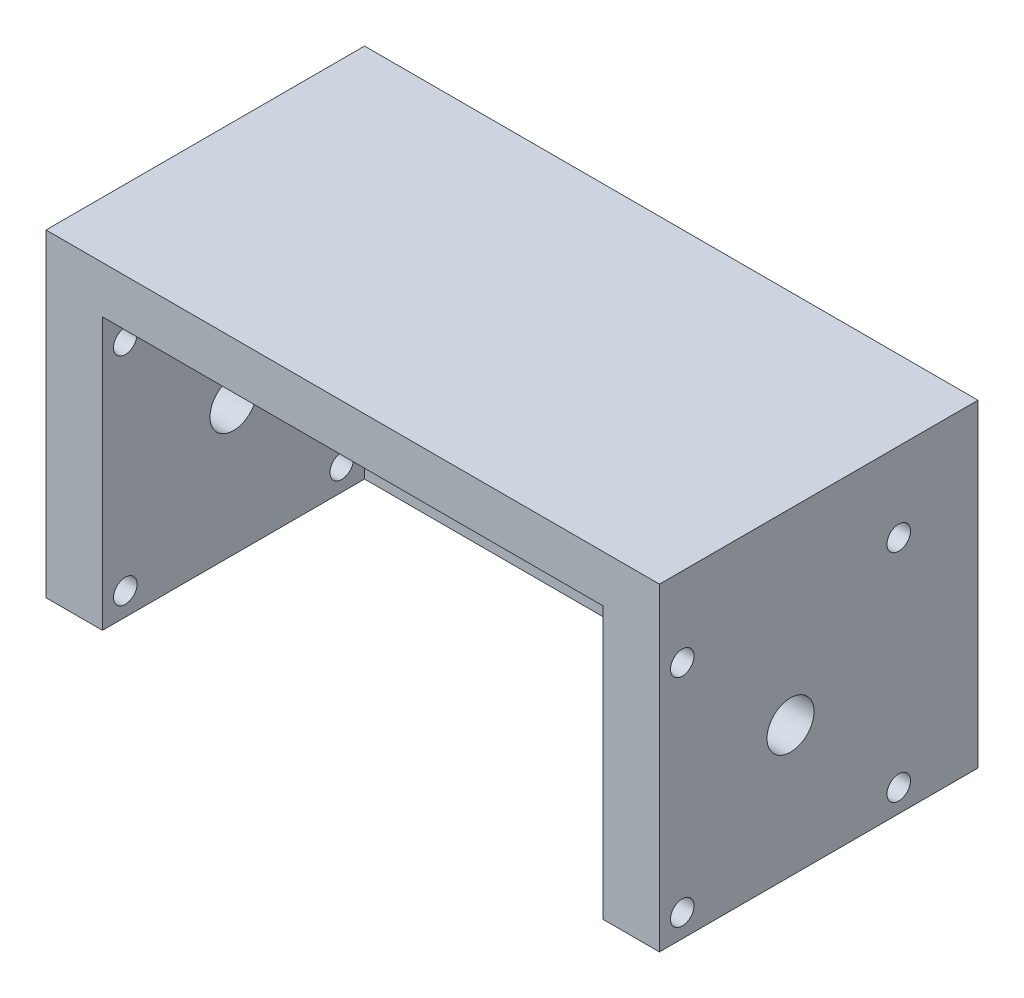
ISO-10303-21;
HEADER;
FILE_DESCRIPTION(('STEP AP214'),'2;1');
FILE_NAME('part.step','',(''),(''),'','','');
FILE_SCHEMA(('AUTOMOTIVE_DESIGN { 1 0 10303 214 1 1 1 1 }'));
ENDSEC;
DATA;
#1=APPLICATION_CONTEXT('core data for automotive mechanical design processes');
#2=APPLICATION_PROTOCOL_DEFINITION('international standard','automotive_design',2000,#1);
#3=PRODUCT_CONTEXT('',#1,'mechanical');
#4=PRODUCT('Part','Part','',(#3));
#5=PRODUCT_RELATED_PRODUCT_CATEGORY('part','',(#4));
#6=PRODUCT_DEFINITION_FORMATION('','',#4);
#7=PRODUCT_DEFINITION_CONTEXT('part definition',#1,'design');
#8=PRODUCT_DEFINITION('design','',#6,#7);
#9=PRODUCT_DEFINITION_SHAPE('','',#8);
#10=(LENGTH_UNIT() NAMED_UNIT(*) SI_UNIT(.MILLI.,.METRE.));
#11=(NAMED_UNIT(*) PLANE_ANGLE_UNIT() SI_UNIT($,.RADIAN.));
#12=(NAMED_UNIT(*) SI_UNIT($,.STERADIAN.) SOLID_ANGLE_UNIT());
#13=UNCERTAINTY_MEASURE_WITH_UNIT(LENGTH_MEASURE(1.E-05),#10,'distance_accuracy_value','');
#14=(GEOMETRIC_REPRESENTATION_CONTEXT(3) GLOBAL_UNCERTAINTY_ASSIGNED_CONTEXT((#13)) GLOBAL_UNIT_ASSIGNED_CONTEXT((#10,
#11,#12)) REPRESENTATION_CONTEXT('',''));
#15=CARTESIAN_POINT('',(0.,0.,0.));
#16=DIRECTION('',(0.,0.,1.));
#17=DIRECTION('',(1.,0.,0.));
#18=AXIS2_PLACEMENT_3D('',#15,#16,#17);
#19=CARTESIAN_POINT('',(0.,0.,6.));
#20=DIRECTION('',(0.,0.,1.));
#21=DIRECTION('',(1.,0.,0.));
#22=AXIS2_PLACEMENT_3D('',#19,#20,#21);
#23=PLANE('',#22);
#24=CARTESIAN_POINT('',(-1.63316091954023,-12.0652011494253,6.));
#25=DIRECTION('',(0.,0.,1.));
#26=DIRECTION('',(1.,0.,0.));
#27=AXIS2_PLACEMENT_3D('',#24,#25,#26);
#28=CIRCLE('',#27,1.25);
#29=CARTESIAN_POINT('',(-0.383160919540232,-12.0652011494253,6.));
#30=VERTEX_POINT('',#29);
#31=EDGE_CURVE('E217',#30,#30,#28,.T.);
#32=ORIENTED_EDGE('',*,*,#31,.F.);
#33=EDGE_LOOP('',(#32));
#34=FACE_BOUND('',#33,.T.);
#35=CARTESIAN_POINT('',(21.3668390804598,-12.0652011494253,6.));
#36=DIRECTION('',(0.,0.,1.));
#37=DIRECTION('',(1.,0.,0.));
#38=AXIS2_PLACEMENT_3D('',#35,#36,#37);
#39=CIRCLE('',#38,1.25);
#40=CARTESIAN_POINT('',(22.6168390804598,-12.0652011494253,6.));
#41=VERTEX_POINT('',#40);
#42=EDGE_CURVE('E221',#41,#41,#39,.T.);
#43=ORIENTED_EDGE('',*,*,#42,.F.);
#44=EDGE_LOOP('',(#43));
#45=FACE_BOUND('',#44,.T.);
#46=CARTESIAN_POINT('',(21.3668390804598,10.9347988505747,6.));
#47=DIRECTION('',(0.,0.,1.));
#48=DIRECTION('',(1.,0.,0.));
#49=AXIS2_PLACEMENT_3D('',#46,#47,#48);
#50=CIRCLE('',#49,1.25);
#51=CARTESIAN_POINT('',(22.6168390804598,10.9347988505747,6.));
#52=VERTEX_POINT('',#51);
#53=EDGE_CURVE('E227',#52,#52,#50,.T.);
#54=ORIENTED_EDGE('',*,*,#53,.F.);
#55=EDGE_LOOP('',(#54));
#56=FACE_BOUND('',#55,.T.);
#57=CARTESIAN_POINT('',(-1.63316091954024,10.9347988505747,6.));
#58=DIRECTION('',(0.,0.,1.));
#59=DIRECTION('',(1.,0.,0.));
#60=AXIS2_PLACEMENT_3D('',#57,#58,#59);
#61=CIRCLE('',#60,1.25);
#62=CARTESIAN_POINT('',(-0.383160919540235,10.9347988505747,6.));
#63=VERTEX_POINT('',#62);
#64=EDGE_CURVE('E233',#63,#63,#61,.T.);
#65=ORIENTED_EDGE('',*,*,#64,.F.);
#66=EDGE_LOOP('',(#65));
#67=FACE_BOUND('',#66,.T.);
#68=CARTESIAN_POINT('',(9.86683908045977,-0.565201149425284,6.));
#69=DIRECTION('',(0.,0.,1.));
#70=DIRECTION('',(1.,0.,0.));
#71=AXIS2_PLACEMENT_3D('',#68,#69,#70);
#72=CIRCLE('',#71,2.5);
#73=CARTESIAN_POINT('',(12.3668390804598,-0.565201149425284,6.));
#74=VERTEX_POINT('',#73);
#75=EDGE_CURVE('E239',#74,#74,#72,.T.);
#76=ORIENTED_EDGE('',*,*,#75,.F.);
#77=EDGE_LOOP('',(#76));
#78=FACE_BOUND('',#77,.T.);
#79=DIRECTION('',(1.,0.,0.));
#80=VECTOR('',#79,1.);
#81=CARTESIAN_POINT('',(-22.7281609195402,-14.4852011494253,6.));
#82=LINE('',#81,#80);
#83=CARTESIAN_POINT('',(-16.7281609195402,-14.4852011494253,5.99999999999999));
#84=VERTEX_POINT('',#83);
#85=CARTESIAN_POINT('',(36.4618390804598,-14.4852011494253,5.99999999999999));
#86=VERTEX_POINT('',#85);
#87=EDGE_CURVE('E248',#84,#86,#82,.T.);
#88=ORIENTED_EDGE('',*,*,#87,.T.);
#89=DIRECTION('',(0.,1.,0.));
#90=VECTOR('',#89,1.);
#91=CARTESIAN_POINT('',(36.4618390804598,13.3647988505747,5.99999999999999));
#92=LINE('',#91,#90);
#93=CARTESIAN_POINT('',(36.4618390804598,14.3647988505747,5.99999999999999));
#94=VERTEX_POINT('',#93);
#95=EDGE_CURVE('E159',#86,#94,#92,.T.);
#96=ORIENTED_EDGE('',*,*,#95,.T.);
#97=DIRECTION('',(1.,0.,0.));
#98=VECTOR('',#97,1.);
#99=CARTESIAN_POINT('',(36.4618390804598,14.3647988505747,5.99999999999999));
#100=LINE('',#99,#98);
#101=CARTESIAN_POINT('',(-16.7281609195402,14.3647988505747,5.99999999999999));
#102=VERTEX_POINT('',#101);
#103=EDGE_CURVE('E117',#102,#94,#100,.T.);
#104=ORIENTED_EDGE('',*,*,#103,.F.);
#105=DIRECTION('',(0.,1.,0.));
#106=VECTOR('',#105,1.);
#107=CARTESIAN_POINT('',(-16.7281609195402,13.3647988505747,5.99999999999999));
#108=LINE('',#107,#106);
#109=EDGE_CURVE('E196',#84,#102,#108,.T.);
#110=ORIENTED_EDGE('',*,*,#109,.F.);
#111=EDGE_LOOP('',(#88,#96,#104,#110));
#112=FACE_BOUND('',#111,.T.);
#113=ADVANCED_FACE('F35',(#34,#45,#56,#67,#78,#112),#23,.T.);
#114=CARTESIAN_POINT('',(-22.7281609195402,13.3647988505747,6.));
#115=DIRECTION('',(1.,0.,0.));
#116=DIRECTION('',(0.,0.,-1.));
#117=AXIS2_PLACEMENT_3D('',#114,#115,#116);
#118=PLANE('',#117);
#119=DIRECTION('',(0.,0.,-1.));
#120=VECTOR('',#119,1.);
#121=CARTESIAN_POINT('',(-22.7281609195402,-14.4852011494253,6.));
#122=LINE('',#121,#120);
#123=CARTESIAN_POINT('',(-22.7281609195402,-14.4852011494253,33.85));
#124=VERTEX_POINT('',#123);
#125=CARTESIAN_POINT('',(-22.7281609195402,-14.4852011494253,0.));
#126=VERTEX_POINT('',#125);
#127=EDGE_CURVE('E11',#124,#126,#122,.T.);
#128=ORIENTED_EDGE('',*,*,#127,.F.);
#129=DIRECTION('',(0.,-1.,0.));
#130=VECTOR('',#129,1.);
#131=CARTESIAN_POINT('',(-22.7281609195402,19.3647988505747,33.85));
#132=LINE('',#131,#130);
#133=CARTESIAN_POINT('',(-22.7281609195402,19.3647988505747,33.85));
#134=VERTEX_POINT('',#133);
#135=EDGE_CURVE('E214',#134,#124,#132,.T.);
#136=ORIENTED_EDGE('',*,*,#135,.F.);
#137=DIRECTION('',(0.,0.,1.));
#138=VECTOR('',#137,1.);
#139=CARTESIAN_POINT('',(-22.7281609195402,19.3647988505747,33.85));
#140=LINE('',#139,#138);
#141=CARTESIAN_POINT('',(-22.7281609195402,19.3647988505747,0.));
#142=VERTEX_POINT('',#141);
#143=EDGE_CURVE('E207',#142,#134,#140,.T.);
#144=ORIENTED_EDGE('',*,*,#143,.F.);
#145=DIRECTION('',(0.,-1.,0.));
#146=VECTOR('',#145,1.);
#147=CARTESIAN_POINT('',(-22.7281609195402,13.3647988505747,0.));
#148=LINE('',#147,#146);
#149=EDGE_CURVE('E245',#142,#126,#148,.T.);
#150=ORIENTED_EDGE('',*,*,#149,.T.);
#151=EDGE_LOOP('',(#128,#136,#144,#150));
#152=FACE_BOUND('',#151,.T.);
#153=CARTESIAN_POINT('',(-22.7281609195402,10.9347988505747,8.42499999999999));
#154=DIRECTION('',(1.,0.,0.));
#155=DIRECTION('',(0.,0.,-1.));
#156=AXIS2_PLACEMENT_3D('',#153,#154,#155);
#157=CIRCLE('',#156,1.25);
#158=CARTESIAN_POINT('',(-22.7281609195402,10.9347988505747,7.17499999999999));
#159=VERTEX_POINT('',#158);
#160=EDGE_CURVE('E185',#159,#159,#157,.T.);
#161=ORIENTED_EDGE('',*,*,#160,.T.);
#162=EDGE_LOOP('',(#161));
#163=FACE_BOUND('',#162,.T.);
#164=CARTESIAN_POINT('',(-22.7281609195402,10.9347988505747,31.425));
#165=DIRECTION('',(1.,0.,0.));
#166=DIRECTION('',(0.,0.,-1.));
#167=AXIS2_PLACEMENT_3D('',#164,#165,#166);
#168=CIRCLE('',#167,1.25);
#169=CARTESIAN_POINT('',(-22.7281609195402,10.9347988505747,30.175));
#170=VERTEX_POINT('',#169);
#171=EDGE_CURVE('E179',#170,#170,#168,.T.);
#172=ORIENTED_EDGE('',*,*,#171,.T.);
#173=EDGE_LOOP('',(#172));
#174=FACE_BOUND('',#173,.T.);
#175=CARTESIAN_POINT('',(-22.7281609195402,-12.0552011494253,31.425));
#176=DIRECTION('',(1.,0.,0.));
#177=DIRECTION('',(0.,0.,-1.));
#178=AXIS2_PLACEMENT_3D('',#175,#176,#177);
#179=CIRCLE('',#178,1.25);
#180=CARTESIAN_POINT('',(-22.7281609195402,-12.0552011494253,30.175));
#181=VERTEX_POINT('',#180);
#182=EDGE_CURVE('E173',#181,#181,#179,.T.);
#183=ORIENTED_EDGE('',*,*,#182,.T.);
#184=EDGE_LOOP('',(#183));
#185=FACE_BOUND('',#184,.T.);
#186=CARTESIAN_POINT('',(-22.7281609195402,-12.0552011494253,8.425));
#187=DIRECTION('',(1.,0.,0.));
#188=DIRECTION('',(0.,0.,-1.));
#189=AXIS2_PLACEMENT_3D('',#186,#187,#188);
#190=CIRCLE('',#189,1.25);
#191=CARTESIAN_POINT('',(-22.7281609195402,-12.0552011494253,7.175));
#192=VERTEX_POINT('',#191);
#193=EDGE_CURVE('E167',#192,#192,#190,.T.);
#194=ORIENTED_EDGE('',*,*,#193,.T.);
#195=EDGE_LOOP('',(#194));
#196=FACE_BOUND('',#195,.T.);
#197=CARTESIAN_POINT('',(-22.7281609195402,-0.560201149425279,19.925));
#198=DIRECTION('',(1.,0.,0.));
#199=DIRECTION('',(0.,0.,-1.));
#200=AXIS2_PLACEMENT_3D('',#197,#198,#199);
#201=CIRCLE('',#200,2.5);
#202=CARTESIAN_POINT('',(-22.7281609195402,-0.56020114942528,17.425));
#203=VERTEX_POINT('',#202);
#204=EDGE_CURVE('E163',#203,#203,#201,.T.);
#205=ORIENTED_EDGE('',*,*,#204,.T.);
#206=EDGE_LOOP('',(#205));
#207=FACE_BOUND('',#206,.T.);
#208=ADVANCED_FACE('F37',(#152,#163,#174,#185,#196,#207),#118,.F.);
#209=CARTESIAN_POINT('',(-22.7281609195402,-14.4852011494253,6.));
#210=DIRECTION('',(0.,1.,0.));
#211=DIRECTION('',(0.,0.,1.));
#212=AXIS2_PLACEMENT_3D('',#209,#210,#211);
#213=PLANE('',#212);
#214=DIRECTION('',(1.,0.,0.));
#215=VECTOR('',#214,1.);
#216=CARTESIAN_POINT('',(-22.7281609195402,-14.4852011494253,0.));
#217=LINE('',#216,#215);
#218=CARTESIAN_POINT('',(42.4618390804598,-14.4852011494253,0.));
#219=VERTEX_POINT('',#218);
#220=EDGE_CURVE('E49',#126,#219,#217,.T.);
#221=ORIENTED_EDGE('',*,*,#220,.T.);
#222=DIRECTION('',(0.,0.,-1.));
#223=VECTOR('',#222,1.);
#224=CARTESIAN_POINT('',(42.4618390804598,-14.4852011494253,6.));
#225=LINE('',#224,#223);
#226=CARTESIAN_POINT('',(42.4618390804598,-14.4852011494253,33.85));
#227=VERTEX_POINT('',#226);
#228=EDGE_CURVE('E43',#227,#219,#225,.T.);
#229=ORIENTED_EDGE('',*,*,#228,.F.);
#230=DIRECTION('',(-1.,0.,0.));
#231=VECTOR('',#230,1.);
#232=CARTESIAN_POINT('',(42.4618390804598,-14.4852011494253,33.85));
#233=LINE('',#232,#231);
#234=CARTESIAN_POINT('',(36.4618390804598,-14.4852011494253,33.85));
#235=VERTEX_POINT('',#234);
#236=EDGE_CURVE('E161',#227,#235,#233,.T.);
#237=ORIENTED_EDGE('',*,*,#236,.T.);
#238=DIRECTION('',(0.,0.,-1.));
#239=VECTOR('',#238,1.);
#240=CARTESIAN_POINT('',(36.4618390804598,-14.4852011494253,33.85));
#241=LINE('',#240,#239);
#242=EDGE_CURVE('E104',#235,#86,#241,.T.);
#243=ORIENTED_EDGE('',*,*,#242,.T.);
#244=ORIENTED_EDGE('',*,*,#87,.F.);
#245=DIRECTION('',(0.,0.,-1.));
#246=VECTOR('',#245,1.);
#247=CARTESIAN_POINT('',(-16.7281609195402,-14.4852011494253,33.85));
#248=LINE('',#247,#246);
#249=CARTESIAN_POINT('',(-16.7281609195402,-14.4852011494253,33.85));
#250=VERTEX_POINT('',#249);
#251=EDGE_CURVE('E194',#250,#84,#248,.T.);
#252=ORIENTED_EDGE('',*,*,#251,.F.);
#253=DIRECTION('',(-1.,0.,0.));
#254=VECTOR('',#253,1.);
#255=CARTESIAN_POINT('',(-16.7281609195402,-14.4852011494253,33.85));
#256=LINE('',#255,#254);
#257=EDGE_CURVE('E198',#250,#124,#256,.T.);
#258=ORIENTED_EDGE('',*,*,#257,.T.);
#259=ORIENTED_EDGE('',*,*,#127,.T.);
#260=EDGE_LOOP('',(#221,#229,#237,#243,#244,#252,#258,#259));
#261=FACE_BOUND('',#260,.T.);
#262=ADVANCED_FACE('F267',(#261),#213,.F.);
#263=CARTESIAN_POINT('',(42.4618390804598,13.3647988505747,6.));
#264=DIRECTION('',(-1.,0.,0.));
#265=DIRECTION('',(0.,0.,1.));
#266=AXIS2_PLACEMENT_3D('',#263,#264,#265);
#267=PLANE('',#266);
#268=DIRECTION('',(0.,1.,0.));
#269=VECTOR('',#268,1.);
#270=CARTESIAN_POINT('',(42.4618390804598,13.3647988505747,0.));
#271=LINE('',#270,#269);
#272=CARTESIAN_POINT('',(42.4618390804598,19.3647988505747,0.));
#273=VERTEX_POINT('',#272);
#274=EDGE_CURVE('E251',#219,#273,#271,.T.);
#275=ORIENTED_EDGE('',*,*,#274,.T.);
#276=DIRECTION('',(0.,0.,-1.));
#277=VECTOR('',#276,1.);
#278=CARTESIAN_POINT('',(42.4618390804598,19.3647988505747,33.85));
#279=LINE('',#278,#277);
#280=CARTESIAN_POINT('',(42.4618390804598,19.3647988505747,33.85));
#281=VERTEX_POINT('',#280);
#282=EDGE_CURVE('E201',#281,#273,#279,.T.);
#283=ORIENTED_EDGE('',*,*,#282,.F.);
#284=DIRECTION('',(0.,-1.,0.));
#285=VECTOR('',#284,1.);
#286=CARTESIAN_POINT('',(42.4618390804598,19.3647988505747,33.85));
#287=LINE('',#286,#285);
#288=EDGE_CURVE('E211',#281,#227,#287,.T.);
#289=ORIENTED_EDGE('',*,*,#288,.T.);
#290=ORIENTED_EDGE('',*,*,#228,.T.);
#291=EDGE_LOOP('',(#275,#283,#289,#290));
#292=FACE_BOUND('',#291,.T.);
#293=CARTESIAN_POINT('',(42.4618390804598,-12.0552011494253,8.425));
#294=DIRECTION('',(1.,0.,0.));
#295=DIRECTION('',(0.,0.,-1.));
#296=AXIS2_PLACEMENT_3D('',#293,#294,#295);
#297=CIRCLE('',#296,1.25);
#298=CARTESIAN_POINT('',(42.4618390804598,-12.0552011494253,7.175));
#299=VERTEX_POINT('',#298);
#300=EDGE_CURVE('E136',#299,#299,#297,.T.);
#301=ORIENTED_EDGE('',*,*,#300,.F.);
#302=EDGE_LOOP('',(#301));
#303=FACE_BOUND('',#302,.T.);
#304=CARTESIAN_POINT('',(42.4618390804598,10.9347988505747,31.425));
#305=DIRECTION('',(1.,0.,0.));
#306=DIRECTION('',(0.,0.,-1.));
#307=AXIS2_PLACEMENT_3D('',#304,#305,#306);
#308=CIRCLE('',#307,1.25);
#309=CARTESIAN_POINT('',(42.4618390804598,10.9347988505747,30.175));
#310=VERTEX_POINT('',#309);
#311=EDGE_CURVE('E148',#310,#310,#308,.T.);
#312=ORIENTED_EDGE('',*,*,#311,.F.);
#313=EDGE_LOOP('',(#312));
#314=FACE_BOUND('',#313,.T.);
#315=CARTESIAN_POINT('',(42.4618390804598,10.9347988505747,8.42499999999999));
#316=DIRECTION('',(1.,0.,0.));
#317=DIRECTION('',(0.,0.,-1.));
#318=AXIS2_PLACEMENT_3D('',#315,#316,#317);
#319=CIRCLE('',#318,1.25);
#320=CARTESIAN_POINT('',(42.4618390804598,10.9347988505747,7.17499999999999));
#321=VERTEX_POINT('',#320);
#322=EDGE_CURVE('E109',#321,#321,#319,.T.);
#323=ORIENTED_EDGE('',*,*,#322,.F.);
#324=EDGE_LOOP('',(#323));
#325=FACE_BOUND('',#324,.T.);
#326=CARTESIAN_POINT('',(42.4618390804598,-12.0552011494253,31.425));
#327=DIRECTION('',(1.,0.,0.));
#328=DIRECTION('',(0.,0.,-1.));
#329=AXIS2_PLACEMENT_3D('',#326,#327,#328);
#330=CIRCLE('',#329,1.25);
#331=CARTESIAN_POINT('',(42.4618390804598,-12.0552011494253,30.175));
#332=VERTEX_POINT('',#331);
#333=EDGE_CURVE('E142',#332,#332,#330,.T.);
#334=ORIENTED_EDGE('',*,*,#333,.F.);
#335=EDGE_LOOP('',(#334));
#336=FACE_BOUND('',#335,.T.);
#337=CARTESIAN_POINT('',(42.4618390804598,-0.560201149425284,19.925));
#338=DIRECTION('',(1.,0.,0.));
#339=DIRECTION('',(0.,0.,-1.));
#340=AXIS2_PLACEMENT_3D('',#337,#338,#339);
#341=CIRCLE('',#340,2.5);
#342=CARTESIAN_POINT('',(42.4618390804598,-0.560201149425284,17.425));
#343=VERTEX_POINT('',#342);
#344=EDGE_CURVE('E130',#343,#343,#341,.T.);
#345=ORIENTED_EDGE('',*,*,#344,.F.);
#346=EDGE_LOOP('',(#345));
#347=FACE_BOUND('',#346,.T.);
#348=ADVANCED_FACE('F256',(#292,#303,#314,#325,#336,#347),#267,.F.);
#349=CARTESIAN_POINT('',(0.,0.,0.));
#350=DIRECTION('',(0.,0.,1.));
#351=DIRECTION('',(1.,0.,0.));
#352=AXIS2_PLACEMENT_3D('',#349,#350,#351);
#353=PLANE('',#352);
#354=CARTESIAN_POINT('',(-1.63316091954023,-12.0652011494253,0.));
#355=DIRECTION('',(0.,0.,1.));
#356=DIRECTION('',(1.,0.,0.));
#357=AXIS2_PLACEMENT_3D('',#354,#355,#356);
#358=CIRCLE('',#357,1.25);
#359=CARTESIAN_POINT('',(-0.383160919540232,-12.0652011494253,0.));
#360=VERTEX_POINT('',#359);
#361=EDGE_CURVE('E218',#360,#360,#358,.T.);
#362=ORIENTED_EDGE('',*,*,#361,.T.);
#363=EDGE_LOOP('',(#362));
#364=FACE_BOUND('',#363,.T.);
#365=CARTESIAN_POINT('',(21.3668390804598,-12.0652011494253,0.));
#366=DIRECTION('',(0.,0.,1.));
#367=DIRECTION('',(1.,0.,0.));
#368=AXIS2_PLACEMENT_3D('',#365,#366,#367);
#369=CIRCLE('',#368,1.25);
#370=CARTESIAN_POINT('',(22.6168390804598,-12.0652011494253,0.));
#371=VERTEX_POINT('',#370);
#372=EDGE_CURVE('E224',#371,#371,#369,.T.);
#373=ORIENTED_EDGE('',*,*,#372,.T.);
#374=EDGE_LOOP('',(#373));
#375=FACE_BOUND('',#374,.T.);
#376=CARTESIAN_POINT('',(21.3668390804598,10.9347988505747,0.));
#377=DIRECTION('',(0.,0.,1.));
#378=DIRECTION('',(1.,0.,0.));
#379=AXIS2_PLACEMENT_3D('',#376,#377,#378);
#380=CIRCLE('',#379,1.25);
#381=CARTESIAN_POINT('',(22.6168390804598,10.9347988505747,0.));
#382=VERTEX_POINT('',#381);
#383=EDGE_CURVE('E230',#382,#382,#380,.T.);
#384=ORIENTED_EDGE('',*,*,#383,.T.);
#385=EDGE_LOOP('',(#384));
#386=FACE_BOUND('',#385,.T.);
#387=CARTESIAN_POINT('',(-1.63316091954024,10.9347988505747,0.));
#388=DIRECTION('',(0.,0.,1.));
#389=DIRECTION('',(1.,0.,0.));
#390=AXIS2_PLACEMENT_3D('',#387,#388,#389);
#391=CIRCLE('',#390,1.25);
#392=CARTESIAN_POINT('',(-0.383160919540235,10.9347988505747,0.));
#393=VERTEX_POINT('',#392);
#394=EDGE_CURVE('E236',#393,#393,#391,.T.);
#395=ORIENTED_EDGE('',*,*,#394,.T.);
#396=EDGE_LOOP('',(#395));
#397=FACE_BOUND('',#396,.T.);
#398=CARTESIAN_POINT('',(9.86683908045977,-0.565201149425284,0.));
#399=DIRECTION('',(0.,0.,1.));
#400=DIRECTION('',(1.,0.,0.));
#401=AXIS2_PLACEMENT_3D('',#398,#399,#400);
#402=CIRCLE('',#401,2.5);
#403=CARTESIAN_POINT('',(12.3668390804598,-0.565201149425284,0.));
#404=VERTEX_POINT('',#403);
#405=EDGE_CURVE('E242',#404,#404,#402,.T.);
#406=ORIENTED_EDGE('',*,*,#405,.T.);
#407=EDGE_LOOP('',(#406));
#408=FACE_BOUND('',#407,.T.);
#409=ORIENTED_EDGE('',*,*,#149,.F.);
#410=DIRECTION('',(-1.,0.,0.));
#411=VECTOR('',#410,1.);
#412=CARTESIAN_POINT('',(42.4618390804598,19.3647988505747,0.));
#413=LINE('',#412,#411);
#414=EDGE_CURVE('E204',#273,#142,#413,.T.);
#415=ORIENTED_EDGE('',*,*,#414,.F.);
#416=ORIENTED_EDGE('',*,*,#274,.F.);
#417=ORIENTED_EDGE('',*,*,#220,.F.);
#418=EDGE_LOOP('',(#409,#415,#416,#417));
#419=FACE_BOUND('',#418,.T.);
#420=ADVANCED_FACE('F261',(#364,#375,#386,#397,#408,#419),#353,.F.);
#421=CARTESIAN_POINT('',(9.86683908045977,-0.565201149425284,0.));
#422=DIRECTION('',(0.,0.,1.));
#423=DIRECTION('',(1.,0.,0.));
#424=AXIS2_PLACEMENT_3D('',#421,#422,#423);
#425=CYLINDRICAL_SURFACE('',#424,2.5);
#426=ORIENTED_EDGE('',*,*,#405,.F.);
#427=EDGE_LOOP('',(#426));
#428=FACE_BOUND('',#427,.T.);
#429=ORIENTED_EDGE('',*,*,#75,.T.);
#430=EDGE_LOOP('',(#429));
#431=FACE_BOUND('',#430,.T.);
#432=ADVANCED_FACE('F313',(#428,#431),#425,.F.);
#433=CARTESIAN_POINT('',(-1.63316091954024,10.9347988505747,0.));
#434=DIRECTION('',(0.,0.,1.));
#435=DIRECTION('',(1.,0.,0.));
#436=AXIS2_PLACEMENT_3D('',#433,#434,#435);
#437=CYLINDRICAL_SURFACE('',#436,1.25);
#438=ORIENTED_EDGE('',*,*,#394,.F.);
#439=EDGE_LOOP('',(#438));
#440=FACE_BOUND('',#439,.T.);
#441=ORIENTED_EDGE('',*,*,#64,.T.);
#442=EDGE_LOOP('',(#441));
#443=FACE_BOUND('',#442,.T.);
#444=ADVANCED_FACE('F339',(#440,#443),#437,.F.);
#445=CARTESIAN_POINT('',(21.3668390804598,10.9347988505747,0.));
#446=DIRECTION('',(0.,0.,1.));
#447=DIRECTION('',(1.,0.,0.));
#448=AXIS2_PLACEMENT_3D('',#445,#446,#447);
#449=CYLINDRICAL_SURFACE('',#448,1.25);
#450=ORIENTED_EDGE('',*,*,#383,.F.);
#451=EDGE_LOOP('',(#450));
#452=FACE_BOUND('',#451,.T.);
#453=ORIENTED_EDGE('',*,*,#53,.T.);
#454=EDGE_LOOP('',(#453));
#455=FACE_BOUND('',#454,.T.);
#456=ADVANCED_FACE('F347',(#452,#455),#449,.F.);
#457=CARTESIAN_POINT('',(21.3668390804598,-12.0652011494253,0.));
#458=DIRECTION('',(0.,0.,1.));
#459=DIRECTION('',(1.,0.,0.));
#460=AXIS2_PLACEMENT_3D('',#457,#458,#459);
#461=CYLINDRICAL_SURFACE('',#460,1.25);
#462=ORIENTED_EDGE('',*,*,#372,.F.);
#463=EDGE_LOOP('',(#462));
#464=FACE_BOUND('',#463,.T.);
#465=ORIENTED_EDGE('',*,*,#42,.T.);
#466=EDGE_LOOP('',(#465));
#467=FACE_BOUND('',#466,.T.);
#468=ADVANCED_FACE('F354',(#464,#467),#461,.F.);
#469=CARTESIAN_POINT('',(-1.63316091954023,-12.0652011494253,0.));
#470=DIRECTION('',(0.,0.,1.));
#471=DIRECTION('',(1.,0.,0.));
#472=AXIS2_PLACEMENT_3D('',#469,#470,#471);
#473=CYLINDRICAL_SURFACE('',#472,1.25);
#474=ORIENTED_EDGE('',*,*,#361,.F.);
#475=EDGE_LOOP('',(#474));
#476=FACE_BOUND('',#475,.T.);
#477=ORIENTED_EDGE('',*,*,#31,.T.);
#478=EDGE_LOOP('',(#477));
#479=FACE_BOUND('',#478,.T.);
#480=ADVANCED_FACE('F362',(#476,#479),#473,.F.);
#481=CARTESIAN_POINT('',(42.4618390804598,19.3647988505747,33.85));
#482=DIRECTION('',(0.,0.,-1.));
#483=DIRECTION('',(0.,1.,0.));
#484=AXIS2_PLACEMENT_3D('',#481,#482,#483);
#485=PLANE('',#484);
#486=DIRECTION('',(-1.,0.,0.));
#487=VECTOR('',#486,1.);
#488=CARTESIAN_POINT('',(36.4618390804598,14.3647988505747,33.85));
#489=LINE('',#488,#487);
#490=CARTESIAN_POINT('',(36.4618390804598,14.3647988505747,33.85));
#491=VERTEX_POINT('',#490);
#492=CARTESIAN_POINT('',(-16.7281609195402,14.3647988505747,33.85));
#493=VERTEX_POINT('',#492);
#494=EDGE_CURVE('E115',#491,#493,#489,.T.);
#495=ORIENTED_EDGE('',*,*,#494,.F.);
#496=DIRECTION('',(0.,-1.,0.));
#497=VECTOR('',#496,1.);
#498=CARTESIAN_POINT('',(36.4618390804598,13.3647988505747,33.85));
#499=LINE('',#498,#497);
#500=EDGE_CURVE('E97',#491,#235,#499,.T.);
#501=ORIENTED_EDGE('',*,*,#500,.T.);
#502=ORIENTED_EDGE('',*,*,#236,.F.);
#503=ORIENTED_EDGE('',*,*,#288,.F.);
#504=DIRECTION('',(1.,0.,0.));
#505=VECTOR('',#504,1.);
#506=CARTESIAN_POINT('',(42.4618390804598,19.3647988505747,33.85));
#507=LINE('',#506,#505);
#508=EDGE_CURVE('E209',#134,#281,#507,.T.);
#509=ORIENTED_EDGE('',*,*,#508,.F.);
#510=ORIENTED_EDGE('',*,*,#135,.T.);
#511=ORIENTED_EDGE('',*,*,#257,.F.);
#512=DIRECTION('',(0.,-1.,0.));
#513=VECTOR('',#512,1.);
#514=CARTESIAN_POINT('',(-16.7281609195402,13.3647988505747,33.85));
#515=LINE('',#514,#513);
#516=EDGE_CURVE('E122',#493,#250,#515,.T.);
#517=ORIENTED_EDGE('',*,*,#516,.F.);
#518=EDGE_LOOP('',(#495,#501,#502,#503,#509,#510,#511,#517));
#519=FACE_BOUND('',#518,.T.);
#520=ADVANCED_FACE('F119',(#519),#485,.F.);
#521=CARTESIAN_POINT('',(0.,19.3647988505747,0.));
#522=DIRECTION('',(0.,1.,0.));
#523=DIRECTION('',(0.,0.,1.));
#524=AXIS2_PLACEMENT_3D('',#521,#522,#523);
#525=PLANE('',#524);
#526=ORIENTED_EDGE('',*,*,#282,.T.);
#527=ORIENTED_EDGE('',*,*,#414,.T.);
#528=ORIENTED_EDGE('',*,*,#143,.T.);
#529=ORIENTED_EDGE('',*,*,#508,.T.);
#530=EDGE_LOOP('',(#526,#527,#528,#529));
#531=FACE_BOUND('',#530,.T.);
#532=ADVANCED_FACE('F264',(#531),#525,.T.);
#533=CARTESIAN_POINT('',(-16.7281609195402,1.7414517431367,20.9607438016529));
#534=DIRECTION('',(1.,0.,0.));
#535=DIRECTION('',(0.,0.,-1.));
#536=AXIS2_PLACEMENT_3D('',#533,#534,#535);
#537=PLANE('',#536);
#538=CARTESIAN_POINT('',(-16.7281609195402,-12.0552011494253,8.425));
#539=DIRECTION('',(1.,0.,0.));
#540=DIRECTION('',(0.,0.,-1.));
#541=AXIS2_PLACEMENT_3D('',#538,#539,#540);
#542=CIRCLE('',#541,1.25);
#543=CARTESIAN_POINT('',(-16.7281609195402,-12.0552011494253,7.175));
#544=VERTEX_POINT('',#543);
#545=EDGE_CURVE('E170',#544,#544,#542,.T.);
#546=ORIENTED_EDGE('',*,*,#545,.F.);
#547=EDGE_LOOP('',(#546));
#548=FACE_BOUND('',#547,.T.);
#549=CARTESIAN_POINT('',(-16.7281609195402,10.9347988505747,31.425));
#550=DIRECTION('',(1.,0.,0.));
#551=DIRECTION('',(0.,0.,-1.));
#552=AXIS2_PLACEMENT_3D('',#549,#550,#551);
#553=CIRCLE('',#552,1.25);
#554=CARTESIAN_POINT('',(-16.7281609195402,10.9347988505747,30.175));
#555=VERTEX_POINT('',#554);
#556=EDGE_CURVE('E182',#555,#555,#553,.T.);
#557=ORIENTED_EDGE('',*,*,#556,.F.);
#558=EDGE_LOOP('',(#557));
#559=FACE_BOUND('',#558,.T.);
#560=ORIENTED_EDGE('',*,*,#516,.T.);
#561=ORIENTED_EDGE('',*,*,#251,.T.);
#562=ORIENTED_EDGE('',*,*,#109,.T.);
#563=DIRECTION('',(0.,0.,-1.));
#564=VECTOR('',#563,1.);
#565=CARTESIAN_POINT('',(-16.7281609195402,14.3647988505747,33.85));
#566=LINE('',#565,#564);
#567=EDGE_CURVE('E124',#493,#102,#566,.T.);
#568=ORIENTED_EDGE('',*,*,#567,.F.);
#569=EDGE_LOOP('',(#560,#561,#562,#568));
#570=FACE_BOUND('',#569,.T.);
#571=CARTESIAN_POINT('',(-16.7281609195402,10.9347988505747,8.42499999999999));
#572=DIRECTION('',(1.,0.,0.));
#573=DIRECTION('',(0.,0.,-1.));
#574=AXIS2_PLACEMENT_3D('',#571,#572,#573);
#575=CIRCLE('',#574,1.25);
#576=CARTESIAN_POINT('',(-16.7281609195402,10.9347988505747,7.17499999999999));
#577=VERTEX_POINT('',#576);
#578=EDGE_CURVE('E188',#577,#577,#575,.T.);
#579=ORIENTED_EDGE('',*,*,#578,.F.);
#580=EDGE_LOOP('',(#579));
#581=FACE_BOUND('',#580,.T.);
#582=CARTESIAN_POINT('',(-16.7281609195402,-12.0552011494253,31.425));
#583=DIRECTION('',(1.,0.,0.));
#584=DIRECTION('',(0.,0.,-1.));
#585=AXIS2_PLACEMENT_3D('',#582,#583,#584);
#586=CIRCLE('',#585,1.25);
#587=CARTESIAN_POINT('',(-16.7281609195402,-12.0552011494253,30.175));
#588=VERTEX_POINT('',#587);
#589=EDGE_CURVE('E176',#588,#588,#586,.T.);
#590=ORIENTED_EDGE('',*,*,#589,.F.);
#591=EDGE_LOOP('',(#590));
#592=FACE_BOUND('',#591,.T.);
#593=CARTESIAN_POINT('',(-16.7281609195402,-0.560201149425279,19.925));
#594=DIRECTION('',(1.,0.,0.));
#595=DIRECTION('',(0.,0.,-1.));
#596=AXIS2_PLACEMENT_3D('',#593,#594,#595);
#597=CIRCLE('',#596,2.5);
#598=CARTESIAN_POINT('',(-16.7281609195402,-0.560201149425279,17.425));
#599=VERTEX_POINT('',#598);
#600=EDGE_CURVE('E164',#599,#599,#597,.T.);
#601=ORIENTED_EDGE('',*,*,#600,.F.);
#602=EDGE_LOOP('',(#601));
#603=FACE_BOUND('',#602,.T.);
#604=ADVANCED_FACE('F272',(#548,#559,#570,#581,#592,#603),#537,.T.);
#605=CARTESIAN_POINT('',(-16.7281609195402,10.9347988505747,8.42499999999999));
#606=DIRECTION('',(-1.,0.,0.));
#607=DIRECTION('',(0.,0.,1.));
#608=AXIS2_PLACEMENT_3D('',#605,#606,#607);
#609=CYLINDRICAL_SURFACE('',#608,1.25);
#610=ORIENTED_EDGE('',*,*,#578,.T.);
#611=EDGE_LOOP('',(#610));
#612=FACE_BOUND('',#611,.T.);
#613=ORIENTED_EDGE('',*,*,#160,.F.);
#614=EDGE_LOOP('',(#613));
#615=FACE_BOUND('',#614,.T.);
#616=ADVANCED_FACE('F389',(#612,#615),#609,.F.);
#617=CARTESIAN_POINT('',(-16.7281609195402,10.9347988505747,31.425));
#618=DIRECTION('',(-1.,0.,0.));
#619=DIRECTION('',(0.,0.,1.));
#620=AXIS2_PLACEMENT_3D('',#617,#618,#619);
#621=CYLINDRICAL_SURFACE('',#620,1.25);
#622=ORIENTED_EDGE('',*,*,#556,.T.);
#623=EDGE_LOOP('',(#622));
#624=FACE_BOUND('',#623,.T.);
#625=ORIENTED_EDGE('',*,*,#171,.F.);
#626=EDGE_LOOP('',(#625));
#627=FACE_BOUND('',#626,.T.);
#628=ADVANCED_FACE('F392',(#624,#627),#621,.F.);
#629=CARTESIAN_POINT('',(-16.7281609195402,-12.0552011494253,31.425));
#630=DIRECTION('',(-1.,0.,0.));
#631=DIRECTION('',(0.,0.,1.));
#632=AXIS2_PLACEMENT_3D('',#629,#630,#631);
#633=CYLINDRICAL_SURFACE('',#632,1.25);
#634=ORIENTED_EDGE('',*,*,#589,.T.);
#635=EDGE_LOOP('',(#634));
#636=FACE_BOUND('',#635,.T.);
#637=ORIENTED_EDGE('',*,*,#182,.F.);
#638=EDGE_LOOP('',(#637));
#639=FACE_BOUND('',#638,.T.);
#640=ADVANCED_FACE('F299',(#636,#639),#633,.F.);
#641=CARTESIAN_POINT('',(-16.7281609195402,-12.0552011494253,8.425));
#642=DIRECTION('',(-1.,0.,0.));
#643=DIRECTION('',(0.,0.,1.));
#644=AXIS2_PLACEMENT_3D('',#641,#642,#643);
#645=CYLINDRICAL_SURFACE('',#644,1.25);
#646=ORIENTED_EDGE('',*,*,#545,.T.);
#647=EDGE_LOOP('',(#646));
#648=FACE_BOUND('',#647,.T.);
#649=ORIENTED_EDGE('',*,*,#193,.F.);
#650=EDGE_LOOP('',(#649));
#651=FACE_BOUND('',#650,.T.);
#652=ADVANCED_FACE('F289',(#648,#651),#645,.F.);
#653=CARTESIAN_POINT('',(-16.7281609195402,-0.560201149425279,19.925));
#654=DIRECTION('',(-1.,0.,0.));
#655=DIRECTION('',(0.,0.,1.));
#656=AXIS2_PLACEMENT_3D('',#653,#654,#655);
#657=CYLINDRICAL_SURFACE('',#656,2.5);
#658=ORIENTED_EDGE('',*,*,#600,.T.);
#659=EDGE_LOOP('',(#658));
#660=FACE_BOUND('',#659,.T.);
#661=ORIENTED_EDGE('',*,*,#204,.F.);
#662=EDGE_LOOP('',(#661));
#663=FACE_BOUND('',#662,.T.);
#664=ADVANCED_FACE('F287',(#660,#663),#657,.F.);
#665=CARTESIAN_POINT('',(36.4618390804598,1.7414517431367,20.9607438016529));
#666=DIRECTION('',(1.,0.,0.));
#667=DIRECTION('',(0.,0.,-1.));
#668=AXIS2_PLACEMENT_3D('',#665,#666,#667);
#669=PLANE('',#668);
#670=ORIENTED_EDGE('',*,*,#500,.F.);
#671=DIRECTION('',(0.,0.,1.));
#672=VECTOR('',#671,1.);
#673=CARTESIAN_POINT('',(36.4618390804598,14.3647988505747,33.85));
#674=LINE('',#673,#672);
#675=EDGE_CURVE('E102',#94,#491,#674,.T.);
#676=ORIENTED_EDGE('',*,*,#675,.F.);
#677=ORIENTED_EDGE('',*,*,#95,.F.);
#678=ORIENTED_EDGE('',*,*,#242,.F.);
#679=EDGE_LOOP('',(#670,#676,#677,#678));
#680=FACE_BOUND('',#679,.T.);
#681=CARTESIAN_POINT('',(36.4618390804598,10.9347988505747,8.42499999999999));
#682=DIRECTION('',(1.,0.,0.));
#683=DIRECTION('',(0.,0.,-1.));
#684=AXIS2_PLACEMENT_3D('',#681,#682,#683);
#685=CIRCLE('',#684,1.25);
#686=CARTESIAN_POINT('',(36.4618390804598,10.9347988505747,7.17499999999999));
#687=VERTEX_POINT('',#686);
#688=EDGE_CURVE('E151',#687,#687,#685,.T.);
#689=ORIENTED_EDGE('',*,*,#688,.T.);
#690=EDGE_LOOP('',(#689));
#691=FACE_BOUND('',#690,.T.);
#692=CARTESIAN_POINT('',(36.4618390804598,10.9347988505747,31.425));
#693=DIRECTION('',(1.,0.,0.));
#694=DIRECTION('',(0.,0.,-1.));
#695=AXIS2_PLACEMENT_3D('',#692,#693,#694);
#696=CIRCLE('',#695,1.25);
#697=CARTESIAN_POINT('',(36.4618390804598,10.9347988505747,30.175));
#698=VERTEX_POINT('',#697);
#699=EDGE_CURVE('E145',#698,#698,#696,.T.);
#700=ORIENTED_EDGE('',*,*,#699,.T.);
#701=EDGE_LOOP('',(#700));
#702=FACE_BOUND('',#701,.T.);
#703=CARTESIAN_POINT('',(36.4618390804598,-12.0552011494253,31.425));
#704=DIRECTION('',(1.,0.,0.));
#705=DIRECTION('',(0.,0.,-1.));
#706=AXIS2_PLACEMENT_3D('',#703,#704,#705);
#707=CIRCLE('',#706,1.25);
#708=CARTESIAN_POINT('',(36.4618390804598,-12.0552011494253,30.175));
#709=VERTEX_POINT('',#708);
#710=EDGE_CURVE('E139',#709,#709,#707,.T.);
#711=ORIENTED_EDGE('',*,*,#710,.T.);
#712=EDGE_LOOP('',(#711));
#713=FACE_BOUND('',#712,.T.);
#714=CARTESIAN_POINT('',(36.4618390804598,-12.0552011494253,8.425));
#715=DIRECTION('',(1.,0.,0.));
#716=DIRECTION('',(0.,0.,-1.));
#717=AXIS2_PLACEMENT_3D('',#714,#715,#716);
#718=CIRCLE('',#717,1.25);
#719=CARTESIAN_POINT('',(36.4618390804598,-12.0552011494253,7.175));
#720=VERTEX_POINT('',#719);
#721=EDGE_CURVE('E133',#720,#720,#718,.T.);
#722=ORIENTED_EDGE('',*,*,#721,.T.);
#723=EDGE_LOOP('',(#722));
#724=FACE_BOUND('',#723,.T.);
#725=CARTESIAN_POINT('',(36.4618390804598,-0.560201149425284,19.925));
#726=DIRECTION('',(1.,0.,0.));
#727=DIRECTION('',(0.,0.,-1.));
#728=AXIS2_PLACEMENT_3D('',#725,#726,#727);
#729=CIRCLE('',#728,2.5);
#730=CARTESIAN_POINT('',(36.4618390804598,-0.560201149425284,17.425));
#731=VERTEX_POINT('',#730);
#732=EDGE_CURVE('E129',#731,#731,#729,.T.);
#733=ORIENTED_EDGE('',*,*,#732,.T.);
#734=EDGE_LOOP('',(#733));
#735=FACE_BOUND('',#734,.T.);
#736=ADVANCED_FACE('F99',(#680,#691,#702,#713,#724,#735),#669,.F.);
#737=CARTESIAN_POINT('',(42.4618390804598,10.9347988505747,8.42499999999999));
#738=DIRECTION('',(-1.,0.,0.));
#739=DIRECTION('',(0.,0.,1.));
#740=AXIS2_PLACEMENT_3D('',#737,#738,#739);
#741=CYLINDRICAL_SURFACE('',#740,1.25);
#742=ORIENTED_EDGE('',*,*,#322,.T.);
#743=EDGE_LOOP('',(#742));
#744=FACE_BOUND('',#743,.T.);
#745=ORIENTED_EDGE('',*,*,#688,.F.);
#746=EDGE_LOOP('',(#745));
#747=FACE_BOUND('',#746,.T.);
#748=ADVANCED_FACE('F297',(#744,#747),#741,.F.);
#749=CARTESIAN_POINT('',(42.4618390804598,10.9347988505747,31.425));
#750=DIRECTION('',(-1.,0.,0.));
#751=DIRECTION('',(0.,0.,1.));
#752=AXIS2_PLACEMENT_3D('',#749,#750,#751);
#753=CYLINDRICAL_SURFACE('',#752,1.25);
#754=ORIENTED_EDGE('',*,*,#311,.T.);
#755=EDGE_LOOP('',(#754));
#756=FACE_BOUND('',#755,.T.);
#757=ORIENTED_EDGE('',*,*,#699,.F.);
#758=EDGE_LOOP('',(#757));
#759=FACE_BOUND('',#758,.T.);
#760=ADVANCED_FACE('F425',(#756,#759),#753,.F.);
#761=CARTESIAN_POINT('',(42.4618390804598,-12.0552011494253,31.425));
#762=DIRECTION('',(-1.,0.,0.));
#763=DIRECTION('',(0.,0.,1.));
#764=AXIS2_PLACEMENT_3D('',#761,#762,#763);
#765=CYLINDRICAL_SURFACE('',#764,1.25);
#766=ORIENTED_EDGE('',*,*,#333,.T.);
#767=EDGE_LOOP('',(#766));
#768=FACE_BOUND('',#767,.T.);
#769=ORIENTED_EDGE('',*,*,#710,.F.);
#770=EDGE_LOOP('',(#769));
#771=FACE_BOUND('',#770,.T.);
#772=ADVANCED_FACE('F436',(#768,#771),#765,.F.);
#773=CARTESIAN_POINT('',(42.4618390804598,-12.0552011494253,8.425));
#774=DIRECTION('',(-1.,0.,0.));
#775=DIRECTION('',(0.,0.,1.));
#776=AXIS2_PLACEMENT_3D('',#773,#774,#775);
#777=CYLINDRICAL_SURFACE('',#776,1.25);
#778=ORIENTED_EDGE('',*,*,#300,.T.);
#779=EDGE_LOOP('',(#778));
#780=FACE_BOUND('',#779,.T.);
#781=ORIENTED_EDGE('',*,*,#721,.F.);
#782=EDGE_LOOP('',(#781));
#783=FACE_BOUND('',#782,.T.);
#784=ADVANCED_FACE('F446',(#780,#783),#777,.F.);
#785=CARTESIAN_POINT('',(42.4618390804598,-0.560201149425284,19.925));
#786=DIRECTION('',(-1.,0.,0.));
#787=DIRECTION('',(0.,0.,1.));
#788=AXIS2_PLACEMENT_3D('',#785,#786,#787);
#789=CYLINDRICAL_SURFACE('',#788,2.5);
#790=ORIENTED_EDGE('',*,*,#344,.T.);
#791=EDGE_LOOP('',(#790));
#792=FACE_BOUND('',#791,.T.);
#793=ORIENTED_EDGE('',*,*,#732,.F.);
#794=EDGE_LOOP('',(#793));
#795=FACE_BOUND('',#794,.T.);
#796=ADVANCED_FACE('F456',(#792,#795),#789,.F.);
#797=CARTESIAN_POINT('',(0.,14.3647988505747,0.));
#798=DIRECTION('',(0.,1.,0.));
#799=DIRECTION('',(0.,0.,1.));
#800=AXIS2_PLACEMENT_3D('',#797,#798,#799);
#801=PLANE('',#800);
#802=ORIENTED_EDGE('',*,*,#675,.T.);
#803=ORIENTED_EDGE('',*,*,#494,.T.);
#804=ORIENTED_EDGE('',*,*,#567,.T.);
#805=ORIENTED_EDGE('',*,*,#103,.T.);
#806=EDGE_LOOP('',(#802,#803,#804,#805));
#807=FACE_BOUND('',#806,.T.);
#808=ADVANCED_FACE('F113',(#807),#801,.F.);
#809=CLOSED_SHELL('',(#113,#208,#262,#348,#420,#432,#444,#456,#468,#480,#520,#532,#604,#616,
#628,#640,#652,#664,#736,#748,#760,#772,#784,#796,#808));
#810=MANIFOLD_SOLID_BREP('B2',#809);
#811=ADVANCED_BREP_SHAPE_REPRESENTATION('',(#18,#810),#14);
#812=SHAPE_DEFINITION_REPRESENTATION(#9,#811);
ENDSEC;
END-ISO-10303-21;
